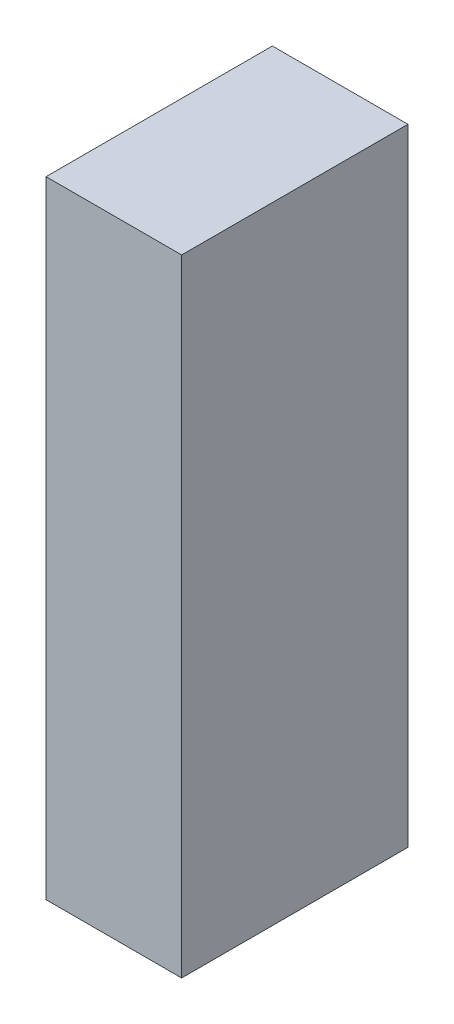
ISO-10303-21;
HEADER;
FILE_DESCRIPTION(('STEP AP214'),'2;1');
FILE_NAME('part.step','',(''),(''),'','','');
FILE_SCHEMA(('AUTOMOTIVE_DESIGN { 1 0 10303 214 1 1 1 1 }'));
ENDSEC;
DATA;
#1=APPLICATION_CONTEXT('core data for automotive mechanical design processes');
#2=APPLICATION_PROTOCOL_DEFINITION('international standard','automotive_design',2000,#1);
#3=PRODUCT_CONTEXT('',#1,'mechanical');
#4=PRODUCT('Part','Part','',(#3));
#5=PRODUCT_RELATED_PRODUCT_CATEGORY('part','',(#4));
#6=PRODUCT_DEFINITION_FORMATION('','',#4);
#7=PRODUCT_DEFINITION_CONTEXT('part definition',#1,'design');
#8=PRODUCT_DEFINITION('design','',#6,#7);
#9=PRODUCT_DEFINITION_SHAPE('','',#8);
#10=(LENGTH_UNIT() NAMED_UNIT(*) SI_UNIT(.MILLI.,.METRE.));
#11=(NAMED_UNIT(*) PLANE_ANGLE_UNIT() SI_UNIT($,.RADIAN.));
#12=(NAMED_UNIT(*) SI_UNIT($,.STERADIAN.) SOLID_ANGLE_UNIT());
#13=UNCERTAINTY_MEASURE_WITH_UNIT(LENGTH_MEASURE(1.E-05),#10,'distance_accuracy_value','');
#14=(GEOMETRIC_REPRESENTATION_CONTEXT(3) GLOBAL_UNCERTAINTY_ASSIGNED_CONTEXT((#13)) GLOBAL_UNIT_ASSIGNED_CONTEXT((#10,
#11,#12)) REPRESENTATION_CONTEXT('',''));
#15=CARTESIAN_POINT('',(0.,0.,0.));
#16=DIRECTION('',(0.,0.,1.));
#17=DIRECTION('',(1.,0.,0.));
#18=AXIS2_PLACEMENT_3D('',#15,#16,#17);
#19=CARTESIAN_POINT('',(0.1375029,-0.635,0.45899832));
#20=DIRECTION('',(0.,0.,-1.));
#21=DIRECTION('',(0.,-1.,0.));
#22=AXIS2_PLACEMENT_3D('',#19,#20,#21);
#23=PLANE('',#22);
#24=DIRECTION('',(0.,1.,0.));
#25=VECTOR('',#24,1.);
#26=CARTESIAN_POINT('',(0.1375029,-0.635,0.45899832));
#27=LINE('',#26,#25);
#28=CARTESIAN_POINT('',(0.1375029,-0.635,0.45899832));
#29=VERTEX_POINT('',#28);
#30=CARTESIAN_POINT('',(0.1375029,0.635,0.45899832));
#31=VERTEX_POINT('',#30);
#32=EDGE_CURVE('E72',#29,#31,#27,.T.);
#33=ORIENTED_EDGE('',*,*,#32,.T.);
#34=DIRECTION('',(-1.,0.,0.));
#35=VECTOR('',#34,1.);
#36=CARTESIAN_POINT('',(0.1375029,0.635,0.45899832));
#37=LINE('',#36,#35);
#38=CARTESIAN_POINT('',(-0.13750036,0.635,0.45899832));
#39=VERTEX_POINT('',#38);
#40=EDGE_CURVE('E70',#31,#39,#37,.T.);
#41=ORIENTED_EDGE('',*,*,#40,.T.);
#42=DIRECTION('',(0.,-1.,0.));
#43=VECTOR('',#42,1.);
#44=CARTESIAN_POINT('',(-0.13750036,0.635,0.45899832));
#45=LINE('',#44,#43);
#46=CARTESIAN_POINT('',(-0.13750036,-0.635,0.45899832));
#47=VERTEX_POINT('',#46);
#48=EDGE_CURVE('E21',#39,#47,#45,.T.);
#49=ORIENTED_EDGE('',*,*,#48,.T.);
#50=DIRECTION('',(1.,0.,0.));
#51=VECTOR('',#50,1.);
#52=CARTESIAN_POINT('',(-0.13750036,-0.635,0.45899832));
#53=LINE('',#52,#51);
#54=EDGE_CURVE('E11',#47,#29,#53,.T.);
#55=ORIENTED_EDGE('',*,*,#54,.T.);
#56=EDGE_LOOP('',(#33,#41,#49,#55));
#57=FACE_BOUND('',#56,.T.);
#58=ADVANCED_FACE('F17',(#57),#23,.F.);
#59=CARTESIAN_POINT('',(0.1375029,-0.635,0.));
#60=DIRECTION('',(0.,0.,-1.));
#61=DIRECTION('',(0.,-1.,0.));
#62=AXIS2_PLACEMENT_3D('',#59,#60,#61);
#63=PLANE('',#62);
#64=DIRECTION('',(0.,1.,0.));
#65=VECTOR('',#64,1.);
#66=CARTESIAN_POINT('',(0.1375029,-0.635,0.));
#67=LINE('',#66,#65);
#68=CARTESIAN_POINT('',(0.1375029,-0.635,0.));
#69=VERTEX_POINT('',#68);
#70=CARTESIAN_POINT('',(0.1375029,0.635,0.));
#71=VERTEX_POINT('',#70);
#72=EDGE_CURVE('E94',#69,#71,#67,.T.);
#73=ORIENTED_EDGE('',*,*,#72,.F.);
#74=DIRECTION('',(1.,0.,0.));
#75=VECTOR('',#74,1.);
#76=CARTESIAN_POINT('',(-0.13750036,-0.635,0.));
#77=LINE('',#76,#75);
#78=CARTESIAN_POINT('',(-0.13750036,-0.635,0.));
#79=VERTEX_POINT('',#78);
#80=EDGE_CURVE('E28',#79,#69,#77,.T.);
#81=ORIENTED_EDGE('',*,*,#80,.F.);
#82=DIRECTION('',(0.,-1.,0.));
#83=VECTOR('',#82,1.);
#84=CARTESIAN_POINT('',(-0.13750036,0.635,0.));
#85=LINE('',#84,#83);
#86=CARTESIAN_POINT('',(-0.13750036,0.635,0.));
#87=VERTEX_POINT('',#86);
#88=EDGE_CURVE('E77',#87,#79,#85,.T.);
#89=ORIENTED_EDGE('',*,*,#88,.F.);
#90=DIRECTION('',(-1.,0.,0.));
#91=VECTOR('',#90,1.);
#92=CARTESIAN_POINT('',(0.1375029,0.635,0.));
#93=LINE('',#92,#91);
#94=EDGE_CURVE('E81',#71,#87,#93,.T.);
#95=ORIENTED_EDGE('',*,*,#94,.F.);
#96=EDGE_LOOP('',(#73,#81,#89,#95));
#97=FACE_BOUND('',#96,.T.);
#98=ADVANCED_FACE('F146',(#97),#63,.T.);
#99=CARTESIAN_POINT('',(-0.13750036,-0.635,0.));
#100=DIRECTION('',(0.,1.,0.));
#101=DIRECTION('',(1.,0.,0.));
#102=AXIS2_PLACEMENT_3D('',#99,#100,#101);
#103=PLANE('',#102);
#104=DIRECTION('',(0.,0.,1.));
#105=VECTOR('',#104,1.);
#106=CARTESIAN_POINT('',(-0.13750036,-0.635,0.));
#107=LINE('',#106,#105);
#108=EDGE_CURVE('E65',#79,#47,#107,.T.);
#109=ORIENTED_EDGE('',*,*,#108,.F.);
#110=ORIENTED_EDGE('',*,*,#80,.T.);
#111=DIRECTION('',(0.,0.,1.));
#112=VECTOR('',#111,1.);
#113=CARTESIAN_POINT('',(0.1375029,-0.635,0.));
#114=LINE('',#113,#112);
#115=EDGE_CURVE('E98',#69,#29,#114,.T.);
#116=ORIENTED_EDGE('',*,*,#115,.T.);
#117=ORIENTED_EDGE('',*,*,#54,.F.);
#118=EDGE_LOOP('',(#109,#110,#116,#117));
#119=FACE_BOUND('',#118,.T.);
#120=ADVANCED_FACE('F151',(#119),#103,.F.);
#121=CARTESIAN_POINT('',(-0.13750036,0.635,0.));
#122=DIRECTION('',(1.,0.,0.));
#123=DIRECTION('',(0.,1.,0.));
#124=AXIS2_PLACEMENT_3D('',#121,#122,#123);
#125=PLANE('',#124);
#126=DIRECTION('',(0.,0.,1.));
#127=VECTOR('',#126,1.);
#128=CARTESIAN_POINT('',(-0.13750036,0.635,0.));
#129=LINE('',#128,#127);
#130=EDGE_CURVE('E63',#87,#39,#129,.T.);
#131=ORIENTED_EDGE('',*,*,#130,.F.);
#132=ORIENTED_EDGE('',*,*,#88,.T.);
#133=ORIENTED_EDGE('',*,*,#108,.T.);
#134=ORIENTED_EDGE('',*,*,#48,.F.);
#135=EDGE_LOOP('',(#131,#132,#133,#134));
#136=FACE_BOUND('',#135,.T.);
#137=ADVANCED_FACE('F19',(#136),#125,.F.);
#138=CARTESIAN_POINT('',(0.1375029,0.635,0.));
#139=DIRECTION('',(0.,-1.,0.));
#140=DIRECTION('',(0.,0.,-1.));
#141=AXIS2_PLACEMENT_3D('',#138,#139,#140);
#142=PLANE('',#141);
#143=DIRECTION('',(0.,0.,1.));
#144=VECTOR('',#143,1.);
#145=CARTESIAN_POINT('',(0.1375029,0.635,0.));
#146=LINE('',#145,#144);
#147=EDGE_CURVE('E91',#71,#31,#146,.T.);
#148=ORIENTED_EDGE('',*,*,#147,.F.);
#149=ORIENTED_EDGE('',*,*,#94,.T.);
#150=ORIENTED_EDGE('',*,*,#130,.T.);
#151=ORIENTED_EDGE('',*,*,#40,.F.);
#152=EDGE_LOOP('',(#148,#149,#150,#151));
#153=FACE_BOUND('',#152,.T.);
#154=ADVANCED_FACE('F79',(#153),#142,.F.);
#155=CARTESIAN_POINT('',(0.1375029,-0.635,0.));
#156=DIRECTION('',(-1.,0.,0.));
#157=DIRECTION('',(0.,0.,1.));
#158=AXIS2_PLACEMENT_3D('',#155,#156,#157);
#159=PLANE('',#158);
#160=ORIENTED_EDGE('',*,*,#115,.F.);
#161=ORIENTED_EDGE('',*,*,#72,.T.);
#162=ORIENTED_EDGE('',*,*,#147,.T.);
#163=ORIENTED_EDGE('',*,*,#32,.F.);
#164=EDGE_LOOP('',(#160,#161,#162,#163));
#165=FACE_BOUND('',#164,.T.);
#166=ADVANCED_FACE('F169',(#165),#159,.F.);
#167=CLOSED_SHELL('',(#58,#98,#120,#137,#154,#166));
#168=MANIFOLD_SOLID_BREP('B1',#167);
#169=ADVANCED_BREP_SHAPE_REPRESENTATION('',(#18,#168),#14);
#170=SHAPE_DEFINITION_REPRESENTATION(#9,#169);
ENDSEC;
END-ISO-10303-21;
